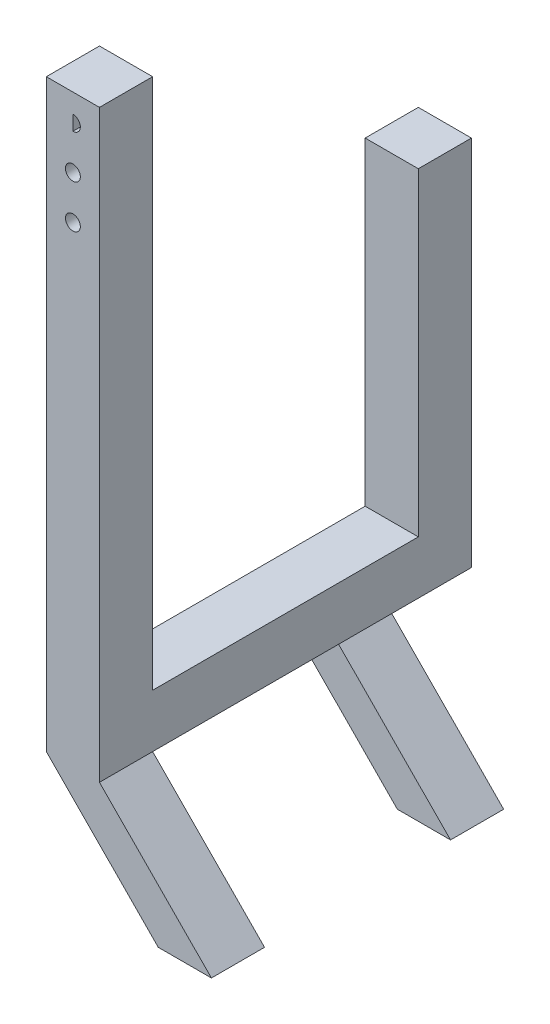
ISO-10303-21;
HEADER;
FILE_DESCRIPTION(('STEP AP214'),'2;1');
FILE_NAME('part.step','',(''),(''),'','','');
FILE_SCHEMA(('AUTOMOTIVE_DESIGN { 1 0 10303 214 1 1 1 1 }'));
ENDSEC;
DATA;
#1=APPLICATION_CONTEXT('core data for automotive mechanical design processes');
#2=APPLICATION_PROTOCOL_DEFINITION('international standard','automotive_design',2000,#1);
#3=PRODUCT_CONTEXT('',#1,'mechanical');
#4=PRODUCT('Part','Part','',(#3));
#5=PRODUCT_RELATED_PRODUCT_CATEGORY('part','',(#4));
#6=PRODUCT_DEFINITION_FORMATION('','',#4);
#7=PRODUCT_DEFINITION_CONTEXT('part definition',#1,'design');
#8=PRODUCT_DEFINITION('design','',#6,#7);
#9=PRODUCT_DEFINITION_SHAPE('','',#8);
#10=(LENGTH_UNIT() NAMED_UNIT(*) SI_UNIT(.MILLI.,.METRE.));
#11=(NAMED_UNIT(*) PLANE_ANGLE_UNIT() SI_UNIT($,.RADIAN.));
#12=(NAMED_UNIT(*) SI_UNIT($,.STERADIAN.) SOLID_ANGLE_UNIT());
#13=UNCERTAINTY_MEASURE_WITH_UNIT(LENGTH_MEASURE(1.E-05),#10,'distance_accuracy_value','');
#14=(GEOMETRIC_REPRESENTATION_CONTEXT(3) GLOBAL_UNCERTAINTY_ASSIGNED_CONTEXT((#13)) GLOBAL_UNIT_ASSIGNED_CONTEXT((#10,
#11,#12)) REPRESENTATION_CONTEXT('',''));
#15=CARTESIAN_POINT('',(0.,0.,0.));
#16=DIRECTION('',(0.,0.,1.));
#17=DIRECTION('',(1.,0.,0.));
#18=AXIS2_PLACEMENT_3D('',#15,#16,#17);
#19=CARTESIAN_POINT('',(0.,0.,12.7));
#20=DIRECTION('',(0.,1.,0.));
#21=DIRECTION('',(0.,0.,1.));
#22=AXIS2_PLACEMENT_3D('',#19,#20,#21);
#23=PLANE('',#22);
#24=DIRECTION('',(1.,0.,0.));
#25=VECTOR('',#24,1.);
#26=CARTESIAN_POINT('',(12.7,0.,-57.15));
#27=LINE('',#26,#25);
#28=CARTESIAN_POINT('',(0.,0.,-57.15));
#29=VERTEX_POINT('',#28);
#30=CARTESIAN_POINT('',(12.7,0.,-57.15));
#31=VERTEX_POINT('',#30);
#32=EDGE_CURVE('E202',#29,#31,#27,.T.);
#33=ORIENTED_EDGE('',*,*,#32,.F.);
#34=DIRECTION('',(0.,0.,-1.));
#35=VECTOR('',#34,1.);
#36=CARTESIAN_POINT('',(0.,0.,12.7));
#37=LINE('',#36,#35);
#38=CARTESIAN_POINT('',(0.,0.,-76.2));
#39=VERTEX_POINT('',#38);
#40=EDGE_CURVE('E342',#29,#39,#37,.T.);
#41=ORIENTED_EDGE('',*,*,#40,.T.);
#42=DIRECTION('',(-1.,0.,0.));
#43=VECTOR('',#42,1.);
#44=CARTESIAN_POINT('',(12.7,0.,-76.2));
#45=LINE('',#44,#43);
#46=CARTESIAN_POINT('',(12.7,0.,-76.2));
#47=VERTEX_POINT('',#46);
#48=EDGE_CURVE('E285',#47,#39,#45,.T.);
#49=ORIENTED_EDGE('',*,*,#48,.F.);
#50=DIRECTION('',(0.,0.,-1.));
#51=VECTOR('',#50,1.);
#52=CARTESIAN_POINT('',(12.7,0.,12.7));
#53=LINE('',#52,#51);
#54=EDGE_CURVE('E348',#31,#47,#53,.T.);
#55=ORIENTED_EDGE('',*,*,#54,.F.);
#56=EDGE_LOOP('',(#33,#41,#49,#55));
#57=FACE_BOUND('',#56,.T.);
#58=ADVANCED_FACE('F40',(#57),#23,.F.);
#59=CARTESIAN_POINT('',(0.,139.7,12.7));
#60=DIRECTION('',(0.,1.,0.));
#61=DIRECTION('',(0.,0.,1.));
#62=AXIS2_PLACEMENT_3D('',#59,#60,#61);
#63=PLANE('',#62);
#64=DIRECTION('',(1.,0.,0.));
#65=VECTOR('',#64,1.);
#66=CARTESIAN_POINT('',(0.,139.7,0.));
#67=LINE('',#66,#65);
#68=CARTESIAN_POINT('',(0.,139.7,0.));
#69=VERTEX_POINT('',#68);
#70=CARTESIAN_POINT('',(12.7,139.7,0.));
#71=VERTEX_POINT('',#70);
#72=EDGE_CURVE('E308',#69,#71,#67,.T.);
#73=ORIENTED_EDGE('',*,*,#72,.F.);
#74=DIRECTION('',(0.,0.,-1.));
#75=VECTOR('',#74,1.);
#76=CARTESIAN_POINT('',(0.,139.7,12.7));
#77=LINE('',#76,#75);
#78=CARTESIAN_POINT('',(0.,139.7,12.7));
#79=VERTEX_POINT('',#78);
#80=EDGE_CURVE('E333',#79,#69,#77,.T.);
#81=ORIENTED_EDGE('',*,*,#80,.F.);
#82=DIRECTION('',(1.,0.,0.));
#83=VECTOR('',#82,1.);
#84=CARTESIAN_POINT('',(0.,139.7,12.7));
#85=LINE('',#84,#83);
#86=CARTESIAN_POINT('',(12.7,139.7,12.7));
#87=VERTEX_POINT('',#86);
#88=EDGE_CURVE('E312',#79,#87,#85,.T.);
#89=ORIENTED_EDGE('',*,*,#88,.T.);
#90=DIRECTION('',(0.,0.,-1.));
#91=VECTOR('',#90,1.);
#92=CARTESIAN_POINT('',(12.7,139.7,12.7));
#93=LINE('',#92,#91);
#94=EDGE_CURVE('E324',#87,#71,#93,.T.);
#95=ORIENTED_EDGE('',*,*,#94,.T.);
#96=EDGE_LOOP('',(#73,#81,#89,#95));
#97=FACE_BOUND('',#96,.T.);
#98=ADVANCED_FACE('F42',(#97),#63,.T.);
#99=CARTESIAN_POINT('',(0.,0.,12.7));
#100=DIRECTION('',(-1.,0.,0.));
#101=DIRECTION('',(0.,0.,1.));
#102=AXIS2_PLACEMENT_3D('',#99,#100,#101);
#103=PLANE('',#102);
#104=DIRECTION('',(0.,1.,0.));
#105=VECTOR('',#104,1.);
#106=CARTESIAN_POINT('',(0.,0.,0.));
#107=LINE('',#106,#105);
#108=CARTESIAN_POINT('',(0.,12.7,0.));
#109=VERTEX_POINT('',#108);
#110=EDGE_CURVE('E317',#109,#69,#107,.T.);
#111=ORIENTED_EDGE('',*,*,#110,.F.);
#112=DIRECTION('',(0.,0.,-1.));
#113=VECTOR('',#112,1.);
#114=CARTESIAN_POINT('',(0.,12.7,0.));
#115=LINE('',#114,#113);
#116=CARTESIAN_POINT('',(0.,12.7,-63.5));
#117=VERTEX_POINT('',#116);
#118=EDGE_CURVE('E289',#109,#117,#115,.T.);
#119=ORIENTED_EDGE('',*,*,#118,.T.);
#120=DIRECTION('',(0.,1.,0.));
#121=VECTOR('',#120,1.);
#122=CARTESIAN_POINT('',(0.,0.,-63.5));
#123=LINE('',#122,#121);
#124=CARTESIAN_POINT('',(0.,88.9,-63.5));
#125=VERTEX_POINT('',#124);
#126=EDGE_CURVE('E260',#117,#125,#123,.T.);
#127=ORIENTED_EDGE('',*,*,#126,.T.);
#128=DIRECTION('',(0.,0.,-1.));
#129=VECTOR('',#128,1.);
#130=CARTESIAN_POINT('',(0.,88.9,-63.5));
#131=LINE('',#130,#129);
#132=CARTESIAN_POINT('',(0.,88.9,-76.2));
#133=VERTEX_POINT('',#132);
#134=EDGE_CURVE('E278',#125,#133,#131,.T.);
#135=ORIENTED_EDGE('',*,*,#134,.T.);
#136=DIRECTION('',(0.,-1.,0.));
#137=VECTOR('',#136,1.);
#138=CARTESIAN_POINT('',(0.,0.,-76.2));
#139=LINE('',#138,#137);
#140=EDGE_CURVE('E267',#133,#39,#139,.T.);
#141=ORIENTED_EDGE('',*,*,#140,.T.);
#142=ORIENTED_EDGE('',*,*,#40,.F.);
#143=DIRECTION('',(0.,0.,-1.));
#144=VECTOR('',#143,1.);
#145=CARTESIAN_POINT('',(0.,0.,-44.45));
#146=LINE('',#145,#144);
#147=CARTESIAN_POINT('',(0.,0.,-44.45));
#148=VERTEX_POINT('',#147);
#149=EDGE_CURVE('E216',#148,#29,#146,.T.);
#150=ORIENTED_EDGE('',*,*,#149,.F.);
#151=CARTESIAN_POINT('',(0.,0.,0.));
#152=VERTEX_POINT('',#151);
#153=EDGE_CURVE('E341',#152,#148,#37,.T.);
#154=ORIENTED_EDGE('',*,*,#153,.F.);
#155=CARTESIAN_POINT('',(0.,0.,12.7));
#156=VERTEX_POINT('',#155);
#157=EDGE_CURVE('E337',#156,#152,#37,.T.);
#158=ORIENTED_EDGE('',*,*,#157,.F.);
#159=DIRECTION('',(0.,1.,0.));
#160=VECTOR('',#159,1.);
#161=CARTESIAN_POINT('',(0.,0.,12.7));
#162=LINE('',#161,#160);
#163=EDGE_CURVE('E320',#156,#79,#162,.T.);
#164=ORIENTED_EDGE('',*,*,#163,.T.);
#165=ORIENTED_EDGE('',*,*,#80,.T.);
#166=EDGE_LOOP('',(#111,#119,#127,#135,#141,#142,#150,#154,#158,#164,#165));
#167=FACE_BOUND('',#166,.T.);
#168=ADVANCED_FACE('F382',(#167),#103,.T.);
#169=ORIENTED_EDGE('',*,*,#153,.T.);
#170=DIRECTION('',(1.,0.,0.));
#171=VECTOR('',#170,1.);
#172=CARTESIAN_POINT('',(12.7,0.,-44.45));
#173=LINE('',#172,#171);
#174=CARTESIAN_POINT('',(12.7,0.,-44.45));
#175=VERTEX_POINT('',#174);
#176=EDGE_CURVE('E184',#148,#175,#173,.T.);
#177=ORIENTED_EDGE('',*,*,#176,.T.);
#178=CARTESIAN_POINT('',(12.7,0.,0.));
#179=VERTEX_POINT('',#178);
#180=EDGE_CURVE('E347',#179,#175,#53,.T.);
#181=ORIENTED_EDGE('',*,*,#180,.F.);
#182=DIRECTION('',(-1.,0.,0.));
#183=VECTOR('',#182,1.);
#184=CARTESIAN_POINT('',(0.,0.,0.));
#185=LINE('',#184,#183);
#186=EDGE_CURVE('E229',#179,#152,#185,.T.);
#187=ORIENTED_EDGE('',*,*,#186,.T.);
#188=EDGE_LOOP('',(#169,#177,#181,#187));
#189=FACE_BOUND('',#188,.T.);
#190=ADVANCED_FACE('F390',(#189),#23,.F.);
#191=CARTESIAN_POINT('',(12.7,0.,12.7));
#192=DIRECTION('',(-1.,0.,0.));
#193=DIRECTION('',(0.,0.,1.));
#194=AXIS2_PLACEMENT_3D('',#191,#192,#193);
#195=PLANE('',#194);
#196=CARTESIAN_POINT('',(12.7,0.,12.7));
#197=VERTEX_POINT('',#196);
#198=EDGE_CURVE('E343',#197,#179,#53,.T.);
#199=ORIENTED_EDGE('',*,*,#198,.T.);
#200=ORIENTED_EDGE('',*,*,#180,.T.);
#201=DIRECTION('',(0.,0.,-1.));
#202=VECTOR('',#201,1.);
#203=CARTESIAN_POINT('',(12.7,0.,-44.45));
#204=LINE('',#203,#202);
#205=EDGE_CURVE('E201',#175,#31,#204,.T.);
#206=ORIENTED_EDGE('',*,*,#205,.T.);
#207=ORIENTED_EDGE('',*,*,#54,.T.);
#208=DIRECTION('',(0.,-1.,0.));
#209=VECTOR('',#208,1.);
#210=CARTESIAN_POINT('',(12.7,0.,-76.2));
#211=LINE('',#210,#209);
#212=CARTESIAN_POINT('',(12.7,88.9,-76.2));
#213=VERTEX_POINT('',#212);
#214=EDGE_CURVE('E271',#213,#47,#211,.T.);
#215=ORIENTED_EDGE('',*,*,#214,.F.);
#216=DIRECTION('',(0.,0.,-1.));
#217=VECTOR('',#216,1.);
#218=CARTESIAN_POINT('',(12.7,88.9,-63.5));
#219=LINE('',#218,#217);
#220=CARTESIAN_POINT('',(12.7,88.9,-63.5));
#221=VERTEX_POINT('',#220);
#222=EDGE_CURVE('E266',#221,#213,#219,.T.);
#223=ORIENTED_EDGE('',*,*,#222,.F.);
#224=DIRECTION('',(0.,1.,0.));
#225=VECTOR('',#224,1.);
#226=CARTESIAN_POINT('',(12.7,0.,-63.5));
#227=LINE('',#226,#225);
#228=CARTESIAN_POINT('',(12.7,12.7,-63.5));
#229=VERTEX_POINT('',#228);
#230=EDGE_CURVE('E263',#229,#221,#227,.T.);
#231=ORIENTED_EDGE('',*,*,#230,.F.);
#232=DIRECTION('',(0.,0.,-1.));
#233=VECTOR('',#232,1.);
#234=CARTESIAN_POINT('',(12.7,12.7,0.));
#235=LINE('',#234,#233);
#236=CARTESIAN_POINT('',(12.7,12.7,0.));
#237=VERTEX_POINT('',#236);
#238=EDGE_CURVE('E296',#237,#229,#235,.T.);
#239=ORIENTED_EDGE('',*,*,#238,.F.);
#240=DIRECTION('',(0.,1.,0.));
#241=VECTOR('',#240,1.);
#242=CARTESIAN_POINT('',(12.7,0.,0.));
#243=LINE('',#242,#241);
#244=EDGE_CURVE('E328',#237,#71,#243,.T.);
#245=ORIENTED_EDGE('',*,*,#244,.T.);
#246=ORIENTED_EDGE('',*,*,#94,.F.);
#247=DIRECTION('',(0.,1.,0.));
#248=VECTOR('',#247,1.);
#249=CARTESIAN_POINT('',(12.7,0.,12.7));
#250=LINE('',#249,#248);
#251=EDGE_CURVE('E316',#197,#87,#250,.T.);
#252=ORIENTED_EDGE('',*,*,#251,.F.);
#253=EDGE_LOOP('',(#199,#200,#206,#207,#215,#223,#231,#239,#245,#246,#252));
#254=FACE_BOUND('',#253,.T.);
#255=ADVANCED_FACE('F373',(#254),#195,.F.);
#256=CARTESIAN_POINT('',(0.,0.,12.7));
#257=DIRECTION('',(0.,0.,1.));
#258=DIRECTION('',(1.,0.,0.));
#259=AXIS2_PLACEMENT_3D('',#256,#257,#258);
#260=PLANE('',#259);
#261=CARTESIAN_POINT('',(6.35,112.7125,12.7));
#262=DIRECTION('',(0.,0.,1.));
#263=DIRECTION('',(1.,0.,0.));
#264=AXIS2_PLACEMENT_3D('',#261,#262,#263);
#265=CIRCLE('',#264,1.778);
#266=CARTESIAN_POINT('',(8.128,112.7125,12.7));
#267=VERTEX_POINT('',#266);
#268=EDGE_CURVE('E174',#267,#267,#265,.T.);
#269=ORIENTED_EDGE('',*,*,#268,.F.);
#270=EDGE_LOOP('',(#269));
#271=FACE_BOUND('',#270,.T.);
#272=DIRECTION('',(0.,-1.,0.));
#273=VECTOR('',#272,1.);
#274=CARTESIAN_POINT('',(6.35000000000002,0.,12.7));
#275=LINE('',#274,#273);
#276=CARTESIAN_POINT('',(6.35,135.128,12.7));
#277=VERTEX_POINT('',#276);
#278=CARTESIAN_POINT('',(6.35,131.572,12.7));
#279=VERTEX_POINT('',#278);
#280=EDGE_CURVE('E57',#277,#279,#275,.T.);
#281=ORIENTED_EDGE('',*,*,#280,.F.);
#282=CARTESIAN_POINT('',(6.35,133.35,12.7));
#283=DIRECTION('',(0.,0.,1.));
#284=DIRECTION('',(1.,0.,0.));
#285=AXIS2_PLACEMENT_3D('',#282,#283,#284);
#286=CIRCLE('',#285,1.778);
#287=EDGE_CURVE('E166',#279,#277,#286,.T.);
#288=ORIENTED_EDGE('',*,*,#287,.F.);
#289=EDGE_LOOP('',(#281,#288));
#290=FACE_BOUND('',#289,.T.);
#291=CARTESIAN_POINT('',(6.35,123.03125,12.7));
#292=DIRECTION('',(0.,0.,1.));
#293=DIRECTION('',(1.,0.,0.));
#294=AXIS2_PLACEMENT_3D('',#291,#292,#293);
#295=CIRCLE('',#294,1.778);
#296=CARTESIAN_POINT('',(8.128,123.03125,12.7));
#297=VERTEX_POINT('',#296);
#298=EDGE_CURVE('E163',#297,#297,#295,.T.);
#299=ORIENTED_EDGE('',*,*,#298,.F.);
#300=EDGE_LOOP('',(#299));
#301=FACE_BOUND('',#300,.T.);
#302=ORIENTED_EDGE('',*,*,#88,.F.);
#303=ORIENTED_EDGE('',*,*,#163,.F.);
#304=DIRECTION('',(0.702180126716796,-0.711999346659802,0.));
#305=VECTOR('',#304,1.);
#306=CARTESIAN_POINT('',(26.7530628279099,-27.1271751077384,12.7));
#307=LINE('',#306,#305);
#308=CARTESIAN_POINT('',(26.7530628279099,-27.1271751077384,12.7));
#309=VERTEX_POINT('',#308);
#310=EDGE_CURVE('E219',#156,#309,#307,.T.);
#311=ORIENTED_EDGE('',*,*,#310,.T.);
#312=DIRECTION('',(1.,0.,0.));
#313=VECTOR('',#312,1.);
#314=CARTESIAN_POINT('',(39.4530628279099,-27.1271751077384,12.7));
#315=LINE('',#314,#313);
#316=CARTESIAN_POINT('',(39.4530628279099,-27.1271751077384,12.7));
#317=VERTEX_POINT('',#316);
#318=EDGE_CURVE('E250',#309,#317,#315,.T.);
#319=ORIENTED_EDGE('',*,*,#318,.T.);
#320=DIRECTION('',(-0.702180126716796,0.711999346659802,0.));
#321=VECTOR('',#320,1.);
#322=CARTESIAN_POINT('',(12.7,0.,12.7));
#323=LINE('',#322,#321);
#324=EDGE_CURVE('E234',#317,#197,#323,.T.);
#325=ORIENTED_EDGE('',*,*,#324,.T.);
#326=ORIENTED_EDGE('',*,*,#251,.T.);
#327=EDGE_LOOP('',(#302,#303,#311,#319,#325,#326));
#328=FACE_BOUND('',#327,.T.);
#329=ADVANCED_FACE('F171',(#271,#290,#301,#328),#260,.T.);
#330=CARTESIAN_POINT('',(0.,0.,0.));
#331=DIRECTION('',(0.,0.,1.));
#332=DIRECTION('',(1.,0.,0.));
#333=AXIS2_PLACEMENT_3D('',#330,#331,#332);
#334=PLANE('',#333);
#335=CARTESIAN_POINT('',(6.35,112.7125,0.));
#336=DIRECTION('',(0.,0.,1.));
#337=DIRECTION('',(1.,0.,0.));
#338=AXIS2_PLACEMENT_3D('',#335,#336,#337);
#339=CIRCLE('',#338,1.778);
#340=CARTESIAN_POINT('',(8.128,112.7125,0.));
#341=VERTEX_POINT('',#340);
#342=EDGE_CURVE('E44',#341,#341,#339,.T.);
#343=ORIENTED_EDGE('',*,*,#342,.T.);
#344=EDGE_LOOP('',(#343));
#345=FACE_BOUND('',#344,.T.);
#346=CARTESIAN_POINT('',(6.35,133.35,0.));
#347=DIRECTION('',(0.,0.,1.));
#348=DIRECTION('',(1.,0.,0.));
#349=AXIS2_PLACEMENT_3D('',#346,#347,#348);
#350=CIRCLE('',#349,1.778);
#351=CARTESIAN_POINT('',(6.35,131.572,0.));
#352=VERTEX_POINT('',#351);
#353=CARTESIAN_POINT('',(6.35,135.128,0.));
#354=VERTEX_POINT('',#353);
#355=EDGE_CURVE('E50',#352,#354,#350,.T.);
#356=ORIENTED_EDGE('',*,*,#355,.T.);
#357=DIRECTION('',(0.,-1.,0.));
#358=VECTOR('',#357,1.);
#359=CARTESIAN_POINT('',(6.35000000000002,0.,0.));
#360=LINE('',#359,#358);
#361=EDGE_CURVE('E12',#354,#352,#360,.T.);
#362=ORIENTED_EDGE('',*,*,#361,.T.);
#363=EDGE_LOOP('',(#356,#362));
#364=FACE_BOUND('',#363,.T.);
#365=CARTESIAN_POINT('',(6.35,123.03125,0.));
#366=DIRECTION('',(0.,0.,1.));
#367=DIRECTION('',(1.,0.,0.));
#368=AXIS2_PLACEMENT_3D('',#365,#366,#367);
#369=CIRCLE('',#368,1.778);
#370=CARTESIAN_POINT('',(8.128,123.03125,0.));
#371=VERTEX_POINT('',#370);
#372=EDGE_CURVE('E178',#371,#371,#369,.T.);
#373=ORIENTED_EDGE('',*,*,#372,.T.);
#374=EDGE_LOOP('',(#373));
#375=FACE_BOUND('',#374,.T.);
#376=ORIENTED_EDGE('',*,*,#244,.F.);
#377=DIRECTION('',(-1.,0.,0.));
#378=VECTOR('',#377,1.);
#379=CARTESIAN_POINT('',(12.7,12.7,0.));
#380=LINE('',#379,#378);
#381=EDGE_CURVE('E304',#237,#109,#380,.T.);
#382=ORIENTED_EDGE('',*,*,#381,.T.);
#383=ORIENTED_EDGE('',*,*,#110,.T.);
#384=ORIENTED_EDGE('',*,*,#72,.T.);
#385=EDGE_LOOP('',(#376,#382,#383,#384));
#386=FACE_BOUND('',#385,.T.);
#387=ADVANCED_FACE('F357',(#345,#364,#375,#386),#334,.F.);
#388=CARTESIAN_POINT('',(12.7,12.7,0.));
#389=DIRECTION('',(0.,1.,0.));
#390=DIRECTION('',(0.,0.,1.));
#391=AXIS2_PLACEMENT_3D('',#388,#389,#390);
#392=PLANE('',#391);
#393=ORIENTED_EDGE('',*,*,#118,.F.);
#394=ORIENTED_EDGE('',*,*,#381,.F.);
#395=ORIENTED_EDGE('',*,*,#238,.T.);
#396=DIRECTION('',(-1.,0.,0.));
#397=VECTOR('',#396,1.);
#398=CARTESIAN_POINT('',(12.7,12.7,-63.5));
#399=LINE('',#398,#397);
#400=EDGE_CURVE('E300',#229,#117,#399,.T.);
#401=ORIENTED_EDGE('',*,*,#400,.T.);
#402=EDGE_LOOP('',(#393,#394,#395,#401));
#403=FACE_BOUND('',#402,.T.);
#404=ADVANCED_FACE('F362',(#403),#392,.T.);
#405=CARTESIAN_POINT('',(12.7,0.,-63.5));
#406=DIRECTION('',(0.,0.,1.));
#407=DIRECTION('',(1.,0.,0.));
#408=AXIS2_PLACEMENT_3D('',#405,#406,#407);
#409=PLANE('',#408);
#410=ORIENTED_EDGE('',*,*,#400,.F.);
#411=ORIENTED_EDGE('',*,*,#230,.T.);
#412=DIRECTION('',(-1.,0.,0.));
#413=VECTOR('',#412,1.);
#414=CARTESIAN_POINT('',(12.7,88.9,-63.5));
#415=LINE('',#414,#413);
#416=EDGE_CURVE('E275',#221,#125,#415,.T.);
#417=ORIENTED_EDGE('',*,*,#416,.T.);
#418=ORIENTED_EDGE('',*,*,#126,.F.);
#419=EDGE_LOOP('',(#410,#411,#417,#418));
#420=FACE_BOUND('',#419,.T.);
#421=ADVANCED_FACE('F420',(#420),#409,.T.);
#422=CARTESIAN_POINT('',(12.7,0.,-76.2));
#423=DIRECTION('',(0.,0.,-1.));
#424=DIRECTION('',(-1.,0.,0.));
#425=AXIS2_PLACEMENT_3D('',#422,#423,#424);
#426=PLANE('',#425);
#427=ORIENTED_EDGE('',*,*,#140,.F.);
#428=DIRECTION('',(-1.,0.,0.));
#429=VECTOR('',#428,1.);
#430=CARTESIAN_POINT('',(12.7,88.9,-76.2));
#431=LINE('',#430,#429);
#432=EDGE_CURVE('E290',#213,#133,#431,.T.);
#433=ORIENTED_EDGE('',*,*,#432,.F.);
#434=ORIENTED_EDGE('',*,*,#214,.T.);
#435=ORIENTED_EDGE('',*,*,#48,.T.);
#436=EDGE_LOOP('',(#427,#433,#434,#435));
#437=FACE_BOUND('',#436,.T.);
#438=ADVANCED_FACE('F413',(#437),#426,.T.);
#439=CARTESIAN_POINT('',(12.7,88.9,-63.5));
#440=DIRECTION('',(0.,1.,0.));
#441=DIRECTION('',(0.,0.,1.));
#442=AXIS2_PLACEMENT_3D('',#439,#440,#441);
#443=PLANE('',#442);
#444=ORIENTED_EDGE('',*,*,#134,.F.);
#445=ORIENTED_EDGE('',*,*,#416,.F.);
#446=ORIENTED_EDGE('',*,*,#222,.T.);
#447=ORIENTED_EDGE('',*,*,#432,.T.);
#448=EDGE_LOOP('',(#444,#445,#446,#447));
#449=FACE_BOUND('',#448,.T.);
#450=ADVANCED_FACE('F416',(#449),#443,.T.);
#451=CARTESIAN_POINT('',(12.7,0.,0.));
#452=DIRECTION('',(0.711999346659802,0.702180126716796,0.));
#453=DIRECTION('',(-0.702180126716796,0.711999346659802,0.));
#454=AXIS2_PLACEMENT_3D('',#451,#452,#453);
#455=PLANE('',#454);
#456=ORIENTED_EDGE('',*,*,#324,.F.);
#457=DIRECTION('',(0.,0.,1.));
#458=VECTOR('',#457,1.);
#459=CARTESIAN_POINT('',(39.4530628279099,-27.1271751077384,0.));
#460=LINE('',#459,#458);
#461=CARTESIAN_POINT('',(39.4530628279099,-27.1271751077384,0.));
#462=VERTEX_POINT('',#461);
#463=EDGE_CURVE('E257',#462,#317,#460,.T.);
#464=ORIENTED_EDGE('',*,*,#463,.F.);
#465=DIRECTION('',(-0.702180126716796,0.711999346659802,0.));
#466=VECTOR('',#465,1.);
#467=CARTESIAN_POINT('',(12.7,0.,0.));
#468=LINE('',#467,#466);
#469=EDGE_CURVE('E242',#462,#179,#468,.T.);
#470=ORIENTED_EDGE('',*,*,#469,.T.);
#471=ORIENTED_EDGE('',*,*,#198,.F.);
#472=EDGE_LOOP('',(#456,#464,#470,#471));
#473=FACE_BOUND('',#472,.T.);
#474=ADVANCED_FACE('F398',(#473),#455,.T.);
#475=CARTESIAN_POINT('',(39.4530628279099,-27.1271751077384,0.));
#476=DIRECTION('',(0.,-1.,0.));
#477=DIRECTION('',(0.,0.,-1.));
#478=AXIS2_PLACEMENT_3D('',#475,#476,#477);
#479=PLANE('',#478);
#480=ORIENTED_EDGE('',*,*,#318,.F.);
#481=DIRECTION('',(0.,0.,1.));
#482=VECTOR('',#481,1.);
#483=CARTESIAN_POINT('',(26.7530628279099,-27.1271751077384,0.));
#484=LINE('',#483,#482);
#485=CARTESIAN_POINT('',(26.7530628279099,-27.1271751077384,0.));
#486=VERTEX_POINT('',#485);
#487=EDGE_CURVE('E246',#486,#309,#484,.T.);
#488=ORIENTED_EDGE('',*,*,#487,.F.);
#489=DIRECTION('',(1.,0.,0.));
#490=VECTOR('',#489,1.);
#491=CARTESIAN_POINT('',(39.4530628279099,-27.1271751077384,0.));
#492=LINE('',#491,#490);
#493=EDGE_CURVE('E238',#486,#462,#492,.T.);
#494=ORIENTED_EDGE('',*,*,#493,.T.);
#495=ORIENTED_EDGE('',*,*,#463,.T.);
#496=EDGE_LOOP('',(#480,#488,#494,#495));
#497=FACE_BOUND('',#496,.T.);
#498=ADVANCED_FACE('F401',(#497),#479,.T.);
#499=CARTESIAN_POINT('',(26.7530628279099,-27.1271751077384,0.));
#500=DIRECTION('',(-0.711999346659802,-0.702180126716796,0.));
#501=DIRECTION('',(0.702180126716796,-0.711999346659802,0.));
#502=AXIS2_PLACEMENT_3D('',#499,#500,#501);
#503=PLANE('',#502);
#504=ORIENTED_EDGE('',*,*,#310,.F.);
#505=ORIENTED_EDGE('',*,*,#157,.T.);
#506=DIRECTION('',(0.702180126716796,-0.711999346659802,0.));
#507=VECTOR('',#506,1.);
#508=CARTESIAN_POINT('',(26.7530628279099,-27.1271751077384,0.));
#509=LINE('',#508,#507);
#510=EDGE_CURVE('E233',#152,#486,#509,.T.);
#511=ORIENTED_EDGE('',*,*,#510,.T.);
#512=ORIENTED_EDGE('',*,*,#487,.T.);
#513=EDGE_LOOP('',(#504,#505,#511,#512));
#514=FACE_BOUND('',#513,.T.);
#515=ADVANCED_FACE('F387',(#514),#503,.T.);
#516=CARTESIAN_POINT('',(0.,0.,0.));
#517=DIRECTION('',(0.,0.,-1.));
#518=DIRECTION('',(-1.,0.,0.));
#519=AXIS2_PLACEMENT_3D('',#516,#517,#518);
#520=PLANE('',#519);
#521=ORIENTED_EDGE('',*,*,#186,.F.);
#522=ORIENTED_EDGE('',*,*,#469,.F.);
#523=ORIENTED_EDGE('',*,*,#493,.F.);
#524=ORIENTED_EDGE('',*,*,#510,.F.);
#525=EDGE_LOOP('',(#521,#522,#523,#524));
#526=FACE_BOUND('',#525,.T.);
#527=ADVANCED_FACE('F394',(#526),#520,.T.);
#528=CARTESIAN_POINT('',(0.,0.,-44.45));
#529=DIRECTION('',(-0.711999346659802,-0.702180126716796,0.));
#530=DIRECTION('',(0.702180126716796,-0.711999346659802,0.));
#531=AXIS2_PLACEMENT_3D('',#528,#529,#530);
#532=PLANE('',#531);
#533=DIRECTION('',(-0.702180126716796,0.711999346659802,0.));
#534=VECTOR('',#533,1.);
#535=CARTESIAN_POINT('',(0.,0.,-57.15));
#536=LINE('',#535,#534);
#537=CARTESIAN_POINT('',(26.7530628279099,-27.1271751077384,-57.15));
#538=VERTEX_POINT('',#537);
#539=EDGE_CURVE('E189',#538,#29,#536,.T.);
#540=ORIENTED_EDGE('',*,*,#539,.F.);
#541=DIRECTION('',(0.,0.,-1.));
#542=VECTOR('',#541,1.);
#543=CARTESIAN_POINT('',(26.7530628279099,-27.1271751077384,-44.45));
#544=LINE('',#543,#542);
#545=CARTESIAN_POINT('',(26.7530628279099,-27.1271751077384,-44.45));
#546=VERTEX_POINT('',#545);
#547=EDGE_CURVE('E220',#546,#538,#544,.T.);
#548=ORIENTED_EDGE('',*,*,#547,.F.);
#549=DIRECTION('',(-0.702180126716796,0.711999346659802,0.));
#550=VECTOR('',#549,1.);
#551=CARTESIAN_POINT('',(0.,0.,-44.45));
#552=LINE('',#551,#550);
#553=EDGE_CURVE('E197',#546,#148,#552,.T.);
#554=ORIENTED_EDGE('',*,*,#553,.T.);
#555=ORIENTED_EDGE('',*,*,#149,.T.);
#556=EDGE_LOOP('',(#540,#548,#554,#555));
#557=FACE_BOUND('',#556,.T.);
#558=ADVANCED_FACE('F477',(#557),#532,.T.);
#559=CARTESIAN_POINT('',(26.7530628279099,-27.1271751077384,-44.45));
#560=DIRECTION('',(0.,-1.,0.));
#561=DIRECTION('',(0.,0.,-1.));
#562=AXIS2_PLACEMENT_3D('',#559,#560,#561);
#563=PLANE('',#562);
#564=DIRECTION('',(-1.,0.,0.));
#565=VECTOR('',#564,1.);
#566=CARTESIAN_POINT('',(26.7530628279099,-27.1271751077384,-57.15));
#567=LINE('',#566,#565);
#568=CARTESIAN_POINT('',(39.4530628279099,-27.1271751077384,-57.15));
#569=VERTEX_POINT('',#568);
#570=EDGE_CURVE('E209',#569,#538,#567,.T.);
#571=ORIENTED_EDGE('',*,*,#570,.F.);
#572=DIRECTION('',(0.,0.,-1.));
#573=VECTOR('',#572,1.);
#574=CARTESIAN_POINT('',(39.4530628279099,-27.1271751077384,-44.45));
#575=LINE('',#574,#573);
#576=CARTESIAN_POINT('',(39.4530628279099,-27.1271751077384,-44.45));
#577=VERTEX_POINT('',#576);
#578=EDGE_CURVE('E223',#577,#569,#575,.T.);
#579=ORIENTED_EDGE('',*,*,#578,.F.);
#580=DIRECTION('',(-1.,0.,0.));
#581=VECTOR('',#580,1.);
#582=CARTESIAN_POINT('',(26.7530628279099,-27.1271751077384,-44.45));
#583=LINE('',#582,#581);
#584=EDGE_CURVE('E193',#577,#546,#583,.T.);
#585=ORIENTED_EDGE('',*,*,#584,.T.);
#586=ORIENTED_EDGE('',*,*,#547,.T.);
#587=EDGE_LOOP('',(#571,#579,#585,#586));
#588=FACE_BOUND('',#587,.T.);
#589=ADVANCED_FACE('F480',(#588),#563,.T.);
#590=CARTESIAN_POINT('',(39.4530628279099,-27.1271751077384,-44.45));
#591=DIRECTION('',(0.711999346659802,0.702180126716796,0.));
#592=DIRECTION('',(-0.702180126716796,0.711999346659802,0.));
#593=AXIS2_PLACEMENT_3D('',#590,#591,#592);
#594=PLANE('',#593);
#595=DIRECTION('',(0.702180126716796,-0.711999346659802,0.));
#596=VECTOR('',#595,1.);
#597=CARTESIAN_POINT('',(39.4530628279099,-27.1271751077384,-57.15));
#598=LINE('',#597,#596);
#599=EDGE_CURVE('E205',#31,#569,#598,.T.);
#600=ORIENTED_EDGE('',*,*,#599,.F.);
#601=ORIENTED_EDGE('',*,*,#205,.F.);
#602=DIRECTION('',(0.702180126716796,-0.711999346659802,0.));
#603=VECTOR('',#602,1.);
#604=CARTESIAN_POINT('',(39.4530628279099,-27.1271751077384,-44.45));
#605=LINE('',#604,#603);
#606=EDGE_CURVE('E188',#175,#577,#605,.T.);
#607=ORIENTED_EDGE('',*,*,#606,.T.);
#608=ORIENTED_EDGE('',*,*,#578,.T.);
#609=EDGE_LOOP('',(#600,#601,#607,#608));
#610=FACE_BOUND('',#609,.T.);
#611=ADVANCED_FACE('F472',(#610),#594,.T.);
#612=CARTESIAN_POINT('',(0.,0.,-44.45));
#613=DIRECTION('',(0.,0.,1.));
#614=DIRECTION('',(1.,0.,0.));
#615=AXIS2_PLACEMENT_3D('',#612,#613,#614);
#616=PLANE('',#615);
#617=ORIENTED_EDGE('',*,*,#176,.F.);
#618=ORIENTED_EDGE('',*,*,#553,.F.);
#619=ORIENTED_EDGE('',*,*,#584,.F.);
#620=ORIENTED_EDGE('',*,*,#606,.F.);
#621=EDGE_LOOP('',(#617,#618,#619,#620));
#622=FACE_BOUND('',#621,.T.);
#623=ADVANCED_FACE('F469',(#622),#616,.T.);
#624=CARTESIAN_POINT('',(0.,0.,-57.15));
#625=DIRECTION('',(0.,0.,1.));
#626=DIRECTION('',(1.,0.,0.));
#627=AXIS2_PLACEMENT_3D('',#624,#625,#626);
#628=PLANE('',#627);
#629=ORIENTED_EDGE('',*,*,#32,.T.);
#630=ORIENTED_EDGE('',*,*,#599,.T.);
#631=ORIENTED_EDGE('',*,*,#570,.T.);
#632=ORIENTED_EDGE('',*,*,#539,.T.);
#633=EDGE_LOOP('',(#629,#630,#631,#632));
#634=FACE_BOUND('',#633,.T.);
#635=ADVANCED_FACE('F467',(#634),#628,.F.);
#636=CARTESIAN_POINT('',(6.35,123.03125,-76.2));
#637=DIRECTION('',(0.,0.,1.));
#638=DIRECTION('',(1.,0.,0.));
#639=AXIS2_PLACEMENT_3D('',#636,#637,#638);
#640=CYLINDRICAL_SURFACE('',#639,1.778);
#641=ORIENTED_EDGE('',*,*,#298,.T.);
#642=EDGE_LOOP('',(#641));
#643=FACE_BOUND('',#642,.T.);
#644=ORIENTED_EDGE('',*,*,#372,.F.);
#645=EDGE_LOOP('',(#644));
#646=FACE_BOUND('',#645,.T.);
#647=ADVANCED_FACE('F463',(#643,#646),#640,.F.);
#648=CARTESIAN_POINT('',(6.35000000000002,0.,-76.2));
#649=DIRECTION('',(-1.,0.,0.));
#650=DIRECTION('',(0.,-1.,0.));
#651=AXIS2_PLACEMENT_3D('',#648,#649,#650);
#652=PLANE('',#651);
#653=DIRECTION('',(0.,0.,1.));
#654=VECTOR('',#653,1.);
#655=CARTESIAN_POINT('',(6.35,135.128,-76.2));
#656=LINE('',#655,#654);
#657=EDGE_CURVE('E64',#354,#277,#656,.T.);
#658=ORIENTED_EDGE('',*,*,#657,.T.);
#659=ORIENTED_EDGE('',*,*,#280,.T.);
#660=DIRECTION('',(0.,0.,1.));
#661=VECTOR('',#660,1.);
#662=CARTESIAN_POINT('',(6.35,131.572,-76.2));
#663=LINE('',#662,#661);
#664=EDGE_CURVE('E162',#352,#279,#663,.T.);
#665=ORIENTED_EDGE('',*,*,#664,.F.);
#666=ORIENTED_EDGE('',*,*,#361,.F.);
#667=EDGE_LOOP('',(#658,#659,#665,#666));
#668=FACE_BOUND('',#667,.T.);
#669=ADVANCED_FACE('F159',(#668),#652,.F.);
#670=CARTESIAN_POINT('',(6.35,133.35,-76.2));
#671=DIRECTION('',(0.,0.,1.));
#672=DIRECTION('',(1.,0.,0.));
#673=AXIS2_PLACEMENT_3D('',#670,#671,#672);
#674=CYLINDRICAL_SURFACE('',#673,1.778);
#675=ORIENTED_EDGE('',*,*,#664,.T.);
#676=ORIENTED_EDGE('',*,*,#287,.T.);
#677=ORIENTED_EDGE('',*,*,#657,.F.);
#678=ORIENTED_EDGE('',*,*,#355,.F.);
#679=EDGE_LOOP('',(#675,#676,#677,#678));
#680=FACE_BOUND('',#679,.T.);
#681=ADVANCED_FACE('F167',(#680),#674,.F.);
#682=CARTESIAN_POINT('',(6.35,112.7125,-76.2));
#683=DIRECTION('',(0.,0.,1.));
#684=DIRECTION('',(1.,0.,0.));
#685=AXIS2_PLACEMENT_3D('',#682,#683,#684);
#686=CYLINDRICAL_SURFACE('',#685,1.778);
#687=ORIENTED_EDGE('',*,*,#268,.T.);
#688=EDGE_LOOP('',(#687));
#689=FACE_BOUND('',#688,.T.);
#690=ORIENTED_EDGE('',*,*,#342,.F.);
#691=EDGE_LOOP('',(#690));
#692=FACE_BOUND('',#691,.T.);
#693=ADVANCED_FACE('F450',(#689,#692),#686,.F.);
#694=CLOSED_SHELL('',(#58,#98,#168,#190,#255,#329,#387,#404,#421,#438,#450,#474,#498,#515,#527,
#558,#589,#611,#623,#635,#647,#669,#681,#693));
#695=MANIFOLD_SOLID_BREP('B2',#694);
#696=ADVANCED_BREP_SHAPE_REPRESENTATION('',(#18,#695),#14);
#697=SHAPE_DEFINITION_REPRESENTATION(#9,#696);
ENDSEC;
END-ISO-10303-21;
